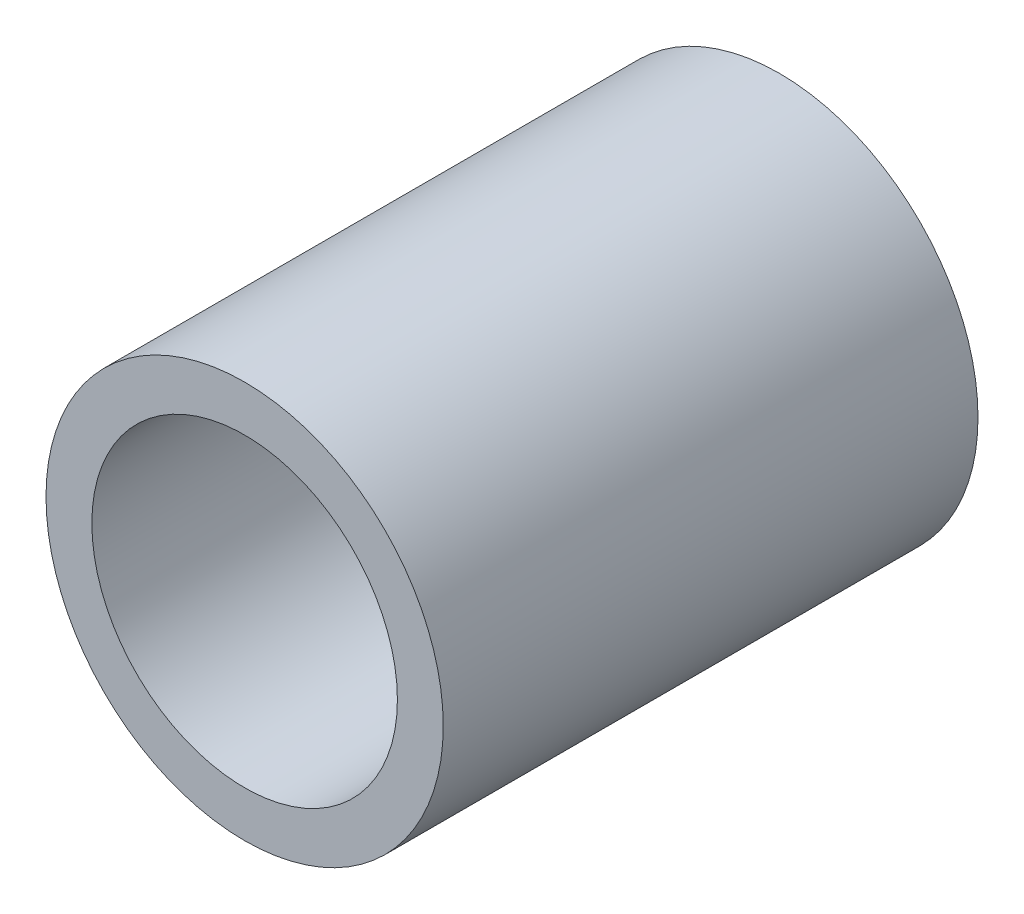
ISO-10303-21;
HEADER;
FILE_DESCRIPTION(('STEP AP214'),'2;1');
FILE_NAME('part.step','',(''),(''),'','','');
FILE_SCHEMA(('AUTOMOTIVE_DESIGN { 1 0 10303 214 1 1 1 1 }'));
ENDSEC;
DATA;
#1=APPLICATION_CONTEXT('core data for automotive mechanical design processes');
#2=APPLICATION_PROTOCOL_DEFINITION('international standard','automotive_design',2000,#1);
#3=PRODUCT_CONTEXT('',#1,'mechanical');
#4=PRODUCT('Part','Part','',(#3));
#5=PRODUCT_RELATED_PRODUCT_CATEGORY('part','',(#4));
#6=PRODUCT_DEFINITION_FORMATION('','',#4);
#7=PRODUCT_DEFINITION_CONTEXT('part definition',#1,'design');
#8=PRODUCT_DEFINITION('design','',#6,#7);
#9=PRODUCT_DEFINITION_SHAPE('','',#8);
#10=(LENGTH_UNIT() NAMED_UNIT(*) SI_UNIT(.MILLI.,.METRE.));
#11=(NAMED_UNIT(*) PLANE_ANGLE_UNIT() SI_UNIT($,.RADIAN.));
#12=(NAMED_UNIT(*) SI_UNIT($,.STERADIAN.) SOLID_ANGLE_UNIT());
#13=UNCERTAINTY_MEASURE_WITH_UNIT(LENGTH_MEASURE(1.E-05),#10,'distance_accuracy_value','');
#14=(GEOMETRIC_REPRESENTATION_CONTEXT(3) GLOBAL_UNCERTAINTY_ASSIGNED_CONTEXT((#13)) GLOBAL_UNIT_ASSIGNED_CONTEXT((#10,
#11,#12)) REPRESENTATION_CONTEXT('',''));
#15=CARTESIAN_POINT('',(0.,0.,0.));
#16=DIRECTION('',(0.,0.,1.));
#17=DIRECTION('',(1.,0.,0.));
#18=AXIS2_PLACEMENT_3D('',#15,#16,#17);
#19=CARTESIAN_POINT('',(0.,0.,35.));
#20=DIRECTION('',(0.,0.,1.));
#21=DIRECTION('',(1.,0.,0.));
#22=AXIS2_PLACEMENT_3D('',#19,#20,#21);
#23=PLANE('',#22);
#24=CARTESIAN_POINT('',(0.,0.,35.));
#25=DIRECTION('',(0.,0.,1.));
#26=DIRECTION('',(1.,0.,0.));
#27=AXIS2_PLACEMENT_3D('',#24,#25,#26);
#28=CIRCLE('',#27,13.);
#29=CARTESIAN_POINT('',(13.,0.,35.));
#30=VERTEX_POINT('',#29);
#31=EDGE_CURVE('E10',#30,#30,#28,.T.);
#32=ORIENTED_EDGE('',*,*,#31,.T.);
#33=EDGE_LOOP('',(#32));
#34=FACE_BOUND('',#33,.T.);
#35=CARTESIAN_POINT('',(0.,0.,35.));
#36=DIRECTION('',(0.,0.,1.));
#37=DIRECTION('',(1.,0.,0.));
#38=AXIS2_PLACEMENT_3D('',#35,#36,#37);
#39=CIRCLE('',#38,10.);
#40=CARTESIAN_POINT('',(10.,0.,35.));
#41=VERTEX_POINT('',#40);
#42=EDGE_CURVE('E50',#41,#41,#39,.T.);
#43=ORIENTED_EDGE('',*,*,#42,.F.);
#44=EDGE_LOOP('',(#43));
#45=FACE_BOUND('',#44,.T.);
#46=ADVANCED_FACE('F37',(#34,#45),#23,.T.);
#47=CARTESIAN_POINT('',(0.,0.,0.));
#48=DIRECTION('',(0.,0.,1.));
#49=DIRECTION('',(1.,0.,0.));
#50=AXIS2_PLACEMENT_3D('',#47,#48,#49);
#51=PLANE('',#50);
#52=CARTESIAN_POINT('',(0.,0.,0.));
#53=DIRECTION('',(0.,0.,1.));
#54=DIRECTION('',(1.,0.,0.));
#55=AXIS2_PLACEMENT_3D('',#52,#53,#54);
#56=CIRCLE('',#55,13.);
#57=CARTESIAN_POINT('',(13.,0.,0.));
#58=VERTEX_POINT('',#57);
#59=EDGE_CURVE('E41',#58,#58,#56,.T.);
#60=ORIENTED_EDGE('',*,*,#59,.F.);
#61=EDGE_LOOP('',(#60));
#62=FACE_BOUND('',#61,.T.);
#63=CARTESIAN_POINT('',(0.,0.,0.));
#64=DIRECTION('',(0.,0.,1.));
#65=DIRECTION('',(1.,0.,0.));
#66=AXIS2_PLACEMENT_3D('',#63,#64,#65);
#67=CIRCLE('',#66,10.);
#68=CARTESIAN_POINT('',(10.,0.,0.));
#69=VERTEX_POINT('',#68);
#70=EDGE_CURVE('E52',#69,#69,#67,.T.);
#71=ORIENTED_EDGE('',*,*,#70,.T.);
#72=EDGE_LOOP('',(#71));
#73=FACE_BOUND('',#72,.T.);
#74=ADVANCED_FACE('F64',(#62,#73),#51,.F.);
#75=CARTESIAN_POINT('',(0.,0.,35.));
#76=DIRECTION('',(0.,0.,-1.));
#77=DIRECTION('',(-1.,0.,0.));
#78=AXIS2_PLACEMENT_3D('',#75,#76,#77);
#79=CYLINDRICAL_SURFACE('',#78,13.);
#80=ORIENTED_EDGE('',*,*,#31,.F.);
#81=EDGE_LOOP('',(#80));
#82=FACE_BOUND('',#81,.T.);
#83=ORIENTED_EDGE('',*,*,#59,.T.);
#84=EDGE_LOOP('',(#83));
#85=FACE_BOUND('',#84,.T.);
#86=ADVANCED_FACE('F39',(#82,#85),#79,.T.);
#87=CARTESIAN_POINT('',(0.,0.,35.));
#88=DIRECTION('',(0.,0.,-1.));
#89=DIRECTION('',(-1.,0.,0.));
#90=AXIS2_PLACEMENT_3D('',#87,#88,#89);
#91=CYLINDRICAL_SURFACE('',#90,10.);
#92=ORIENTED_EDGE('',*,*,#42,.T.);
#93=EDGE_LOOP('',(#92));
#94=FACE_BOUND('',#93,.T.);
#95=ORIENTED_EDGE('',*,*,#70,.F.);
#96=EDGE_LOOP('',(#95));
#97=FACE_BOUND('',#96,.T.);
#98=ADVANCED_FACE('F60',(#94,#97),#91,.F.);
#99=CLOSED_SHELL('',(#46,#74,#86,#98));
#100=MANIFOLD_SOLID_BREP('B2',#99);
#101=ADVANCED_BREP_SHAPE_REPRESENTATION('',(#18,#100),#14);
#102=SHAPE_DEFINITION_REPRESENTATION(#9,#101);
ENDSEC;
END-ISO-10303-21;
